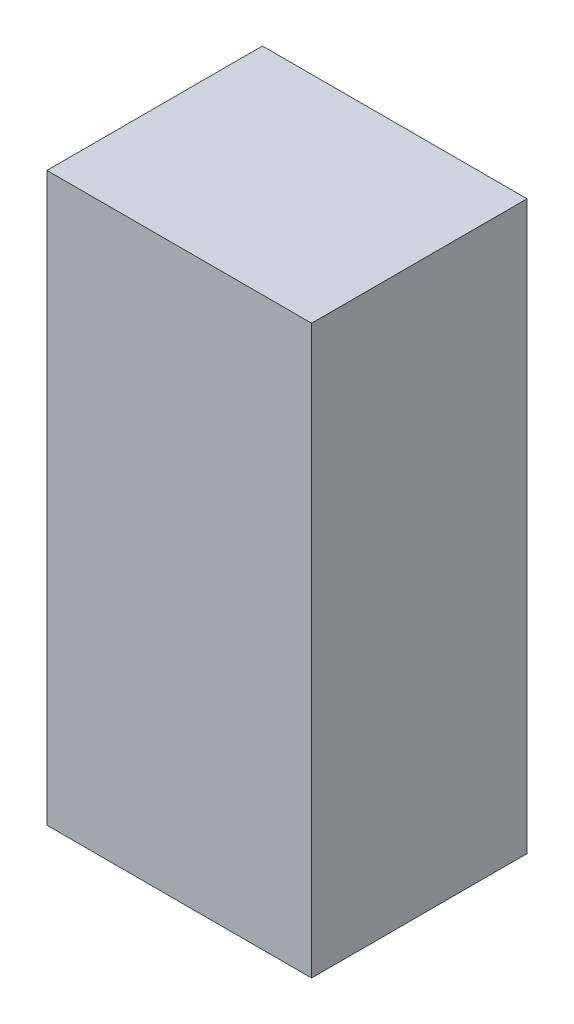
ISO-10303-21;
HEADER;
FILE_DESCRIPTION(('STEP AP214'),'2;1');
FILE_NAME('part.step','',(''),(''),'','','');
FILE_SCHEMA(('AUTOMOTIVE_DESIGN { 1 0 10303 214 1 1 1 1 }'));
ENDSEC;
DATA;
#1=APPLICATION_CONTEXT('core data for automotive mechanical design processes');
#2=APPLICATION_PROTOCOL_DEFINITION('international standard','automotive_design',2000,#1);
#3=PRODUCT_CONTEXT('',#1,'mechanical');
#4=PRODUCT('Part','Part','',(#3));
#5=PRODUCT_RELATED_PRODUCT_CATEGORY('part','',(#4));
#6=PRODUCT_DEFINITION_FORMATION('','',#4);
#7=PRODUCT_DEFINITION_CONTEXT('part definition',#1,'design');
#8=PRODUCT_DEFINITION('design','',#6,#7);
#9=PRODUCT_DEFINITION_SHAPE('','',#8);
#10=(LENGTH_UNIT() NAMED_UNIT(*) SI_UNIT(.MILLI.,.METRE.));
#11=(NAMED_UNIT(*) PLANE_ANGLE_UNIT() SI_UNIT($,.RADIAN.));
#12=(NAMED_UNIT(*) SI_UNIT($,.STERADIAN.) SOLID_ANGLE_UNIT());
#13=UNCERTAINTY_MEASURE_WITH_UNIT(LENGTH_MEASURE(1.E-05),#10,'distance_accuracy_value','');
#14=(GEOMETRIC_REPRESENTATION_CONTEXT(3) GLOBAL_UNCERTAINTY_ASSIGNED_CONTEXT((#13)) GLOBAL_UNIT_ASSIGNED_CONTEXT((#10,
#11,#12)) REPRESENTATION_CONTEXT('',''));
#15=CARTESIAN_POINT('',(0.,0.,0.));
#16=DIRECTION('',(0.,0.,1.));
#17=DIRECTION('',(1.,0.,0.));
#18=AXIS2_PLACEMENT_3D('',#15,#16,#17);
#19=CARTESIAN_POINT('',(0.70000114,1.49999954,1.14000026));
#20=DIRECTION('',(0.,0.,-1.));
#21=DIRECTION('',(0.,-1.,0.));
#22=AXIS2_PLACEMENT_3D('',#19,#20,#21);
#23=PLANE('',#22);
#24=DIRECTION('',(-1.,0.,0.));
#25=VECTOR('',#24,1.);
#26=CARTESIAN_POINT('',(0.70000114,1.49999954,1.14000026));
#27=LINE('',#26,#25);
#28=CARTESIAN_POINT('',(0.70000114,1.49999954,1.14000026));
#29=VERTEX_POINT('',#28);
#30=CARTESIAN_POINT('',(-0.70000114,1.49999954,1.14000026));
#31=VERTEX_POINT('',#30);
#32=EDGE_CURVE('E94',#29,#31,#27,.T.);
#33=ORIENTED_EDGE('',*,*,#32,.T.);
#34=DIRECTION('',(0.,-1.,0.));
#35=VECTOR('',#34,1.);
#36=CARTESIAN_POINT('',(-0.70000114,1.49999954,1.14000026));
#37=LINE('',#36,#35);
#38=CARTESIAN_POINT('',(-0.70000114,-1.49999954,1.14000026));
#39=VERTEX_POINT('',#38);
#40=EDGE_CURVE('E74',#31,#39,#37,.T.);
#41=ORIENTED_EDGE('',*,*,#40,.T.);
#42=DIRECTION('',(1.,0.,0.));
#43=VECTOR('',#42,1.);
#44=CARTESIAN_POINT('',(-0.70000114,-1.49999954,1.14000026));
#45=LINE('',#44,#43);
#46=CARTESIAN_POINT('',(0.70000114,-1.49999954,1.14000026));
#47=VERTEX_POINT('',#46);
#48=EDGE_CURVE('E58',#39,#47,#45,.T.);
#49=ORIENTED_EDGE('',*,*,#48,.T.);
#50=DIRECTION('',(0.,1.,0.));
#51=VECTOR('',#50,1.);
#52=CARTESIAN_POINT('',(0.70000114,-1.49999954,1.14000026));
#53=LINE('',#52,#51);
#54=EDGE_CURVE('E11',#47,#29,#53,.T.);
#55=ORIENTED_EDGE('',*,*,#54,.T.);
#56=EDGE_LOOP('',(#33,#41,#49,#55));
#57=FACE_BOUND('',#56,.T.);
#58=ADVANCED_FACE('F16',(#57),#23,.F.);
#59=CARTESIAN_POINT('',(0.70000114,1.49999954,0.));
#60=DIRECTION('',(0.,0.,-1.));
#61=DIRECTION('',(0.,-1.,0.));
#62=AXIS2_PLACEMENT_3D('',#59,#60,#61);
#63=PLANE('',#62);
#64=DIRECTION('',(0.,1.,0.));
#65=VECTOR('',#64,1.);
#66=CARTESIAN_POINT('',(0.70000114,-1.49999954,0.));
#67=LINE('',#66,#65);
#68=CARTESIAN_POINT('',(0.70000114,-1.49999954,0.));
#69=VERTEX_POINT('',#68);
#70=CARTESIAN_POINT('',(0.70000114,1.49999954,0.));
#71=VERTEX_POINT('',#70);
#72=EDGE_CURVE('E26',#69,#71,#67,.T.);
#73=ORIENTED_EDGE('',*,*,#72,.F.);
#74=DIRECTION('',(1.,0.,0.));
#75=VECTOR('',#74,1.);
#76=CARTESIAN_POINT('',(-0.70000114,-1.49999954,0.));
#77=LINE('',#76,#75);
#78=CARTESIAN_POINT('',(-0.70000114,-1.49999954,0.));
#79=VERTEX_POINT('',#78);
#80=EDGE_CURVE('E67',#79,#69,#77,.T.);
#81=ORIENTED_EDGE('',*,*,#80,.F.);
#82=DIRECTION('',(0.,-1.,0.));
#83=VECTOR('',#82,1.);
#84=CARTESIAN_POINT('',(-0.70000114,1.49999954,0.));
#85=LINE('',#84,#83);
#86=CARTESIAN_POINT('',(-0.70000114,1.49999954,0.));
#87=VERTEX_POINT('',#86);
#88=EDGE_CURVE('E80',#87,#79,#85,.T.);
#89=ORIENTED_EDGE('',*,*,#88,.F.);
#90=DIRECTION('',(-1.,0.,0.));
#91=VECTOR('',#90,1.);
#92=CARTESIAN_POINT('',(0.70000114,1.49999954,0.));
#93=LINE('',#92,#91);
#94=EDGE_CURVE('E93',#71,#87,#93,.T.);
#95=ORIENTED_EDGE('',*,*,#94,.F.);
#96=EDGE_LOOP('',(#73,#81,#89,#95));
#97=FACE_BOUND('',#96,.T.);
#98=ADVANCED_FACE('F97',(#97),#63,.T.);
#99=CARTESIAN_POINT('',(0.70000114,-1.49999954,0.));
#100=DIRECTION('',(-1.,0.,0.));
#101=DIRECTION('',(0.,0.,1.));
#102=AXIS2_PLACEMENT_3D('',#99,#100,#101);
#103=PLANE('',#102);
#104=ORIENTED_EDGE('',*,*,#72,.T.);
#105=DIRECTION('',(0.,0.,1.));
#106=VECTOR('',#105,1.);
#107=CARTESIAN_POINT('',(0.70000114,1.49999954,0.));
#108=LINE('',#107,#106);
#109=EDGE_CURVE('E85',#71,#29,#108,.T.);
#110=ORIENTED_EDGE('',*,*,#109,.T.);
#111=ORIENTED_EDGE('',*,*,#54,.F.);
#112=DIRECTION('',(0.,0.,1.));
#113=VECTOR('',#112,1.);
#114=CARTESIAN_POINT('',(0.70000114,-1.49999954,0.));
#115=LINE('',#114,#113);
#116=EDGE_CURVE('E19',#69,#47,#115,.T.);
#117=ORIENTED_EDGE('',*,*,#116,.F.);
#118=EDGE_LOOP('',(#104,#110,#111,#117));
#119=FACE_BOUND('',#118,.T.);
#120=ADVANCED_FACE('F84',(#119),#103,.F.);
#121=CARTESIAN_POINT('',(-0.70000114,-1.49999954,0.));
#122=DIRECTION('',(0.,1.,0.));
#123=DIRECTION('',(1.,0.,0.));
#124=AXIS2_PLACEMENT_3D('',#121,#122,#123);
#125=PLANE('',#124);
#126=ORIENTED_EDGE('',*,*,#80,.T.);
#127=ORIENTED_EDGE('',*,*,#116,.T.);
#128=ORIENTED_EDGE('',*,*,#48,.F.);
#129=DIRECTION('',(0.,0.,1.));
#130=VECTOR('',#129,1.);
#131=CARTESIAN_POINT('',(-0.70000114,-1.49999954,0.));
#132=LINE('',#131,#130);
#133=EDGE_CURVE('E109',#79,#39,#132,.T.);
#134=ORIENTED_EDGE('',*,*,#133,.F.);
#135=EDGE_LOOP('',(#126,#127,#128,#134));
#136=FACE_BOUND('',#135,.T.);
#137=ADVANCED_FACE('F129',(#136),#125,.F.);
#138=CARTESIAN_POINT('',(-0.70000114,1.49999954,0.));
#139=DIRECTION('',(1.,0.,0.));
#140=DIRECTION('',(0.,1.,0.));
#141=AXIS2_PLACEMENT_3D('',#138,#139,#140);
#142=PLANE('',#141);
#143=ORIENTED_EDGE('',*,*,#88,.T.);
#144=ORIENTED_EDGE('',*,*,#133,.T.);
#145=ORIENTED_EDGE('',*,*,#40,.F.);
#146=DIRECTION('',(0.,0.,1.));
#147=VECTOR('',#146,1.);
#148=CARTESIAN_POINT('',(-0.70000114,1.49999954,0.));
#149=LINE('',#148,#147);
#150=EDGE_CURVE('E99',#87,#31,#149,.T.);
#151=ORIENTED_EDGE('',*,*,#150,.F.);
#152=EDGE_LOOP('',(#143,#144,#145,#151));
#153=FACE_BOUND('',#152,.T.);
#154=ADVANCED_FACE('F117',(#153),#142,.F.);
#155=CARTESIAN_POINT('',(0.70000114,1.49999954,0.));
#156=DIRECTION('',(0.,-1.,0.));
#157=DIRECTION('',(0.,0.,-1.));
#158=AXIS2_PLACEMENT_3D('',#155,#156,#157);
#159=PLANE('',#158);
#160=ORIENTED_EDGE('',*,*,#94,.T.);
#161=ORIENTED_EDGE('',*,*,#150,.T.);
#162=ORIENTED_EDGE('',*,*,#32,.F.);
#163=ORIENTED_EDGE('',*,*,#109,.F.);
#164=EDGE_LOOP('',(#160,#161,#162,#163));
#165=FACE_BOUND('',#164,.T.);
#166=ADVANCED_FACE('F91',(#165),#159,.F.);
#167=CLOSED_SHELL('',(#58,#98,#120,#137,#154,#166));
#168=MANIFOLD_SOLID_BREP('B1',#167);
#169=ADVANCED_BREP_SHAPE_REPRESENTATION('',(#18,#168),#14);
#170=SHAPE_DEFINITION_REPRESENTATION(#9,#169);
ENDSEC;
END-ISO-10303-21;
